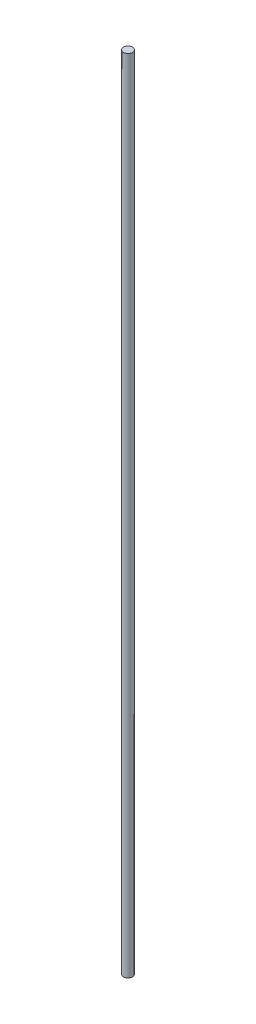
ISO-10303-21;
HEADER;
FILE_DESCRIPTION(('STEP AP214'),'2;1');
FILE_NAME('part.step','',(''),(''),'','','');
FILE_SCHEMA(('AUTOMOTIVE_DESIGN { 1 0 10303 214 1 1 1 1 }'));
ENDSEC;
DATA;
#1=APPLICATION_CONTEXT('core data for automotive mechanical design processes');
#2=APPLICATION_PROTOCOL_DEFINITION('international standard','automotive_design',2000,#1);
#3=PRODUCT_CONTEXT('',#1,'mechanical');
#4=PRODUCT('Part','Part','',(#3));
#5=PRODUCT_RELATED_PRODUCT_CATEGORY('part','',(#4));
#6=PRODUCT_DEFINITION_FORMATION('','',#4);
#7=PRODUCT_DEFINITION_CONTEXT('part definition',#1,'design');
#8=PRODUCT_DEFINITION('design','',#6,#7);
#9=PRODUCT_DEFINITION_SHAPE('','',#8);
#10=(LENGTH_UNIT() NAMED_UNIT(*) SI_UNIT(.MILLI.,.METRE.));
#11=(NAMED_UNIT(*) PLANE_ANGLE_UNIT() SI_UNIT($,.RADIAN.));
#12=(NAMED_UNIT(*) SI_UNIT($,.STERADIAN.) SOLID_ANGLE_UNIT());
#13=UNCERTAINTY_MEASURE_WITH_UNIT(LENGTH_MEASURE(1.E-05),#10,'distance_accuracy_value','');
#14=(GEOMETRIC_REPRESENTATION_CONTEXT(3) GLOBAL_UNCERTAINTY_ASSIGNED_CONTEXT((#13)) GLOBAL_UNIT_ASSIGNED_CONTEXT((#10,
#11,#12)) REPRESENTATION_CONTEXT('',''));
#15=CARTESIAN_POINT('',(0.,0.,0.));
#16=DIRECTION('',(0.,0.,1.));
#17=DIRECTION('',(1.,0.,0.));
#18=AXIS2_PLACEMENT_3D('',#15,#16,#17);
#19=CARTESIAN_POINT('',(0.,700.,0.));
#20=DIRECTION('',(0.,-1.,0.));
#21=DIRECTION('',(1.,0.,0.));
#22=AXIS2_PLACEMENT_3D('',#19,#20,#21);
#23=CYLINDRICAL_SURFACE('',#22,4.00000000000005);
#24=CARTESIAN_POINT('',(0.,700.,0.));
#25=DIRECTION('',(0.,-1.,0.));
#26=DIRECTION('',(1.,0.,0.));
#27=AXIS2_PLACEMENT_3D('',#24,#25,#26);
#28=CIRCLE('',#27,4.00000000000009);
#29=CARTESIAN_POINT('',(4.00000000000017,700.,0.));
#30=VERTEX_POINT('',#29);
#31=EDGE_CURVE('E10',#30,#30,#28,.T.);
#32=ORIENTED_EDGE('',*,*,#31,.T.);
#33=EDGE_LOOP('',(#32));
#34=FACE_BOUND('',#33,.T.);
#35=CARTESIAN_POINT('',(1.66533453693773E-13,0.,0.));
#36=DIRECTION('',(0.,-1.,0.));
#37=DIRECTION('',(1.,0.,0.));
#38=AXIS2_PLACEMENT_3D('',#35,#36,#37);
#39=CIRCLE('',#38,4.);
#40=CARTESIAN_POINT('',(4.00000000000017,0.,0.));
#41=VERTEX_POINT('',#40);
#42=EDGE_CURVE('E44',#41,#41,#39,.T.);
#43=ORIENTED_EDGE('',*,*,#42,.F.);
#44=EDGE_LOOP('',(#43));
#45=FACE_BOUND('',#44,.T.);
#46=ADVANCED_FACE('F37',(#34,#45),#23,.T.);
#47=CARTESIAN_POINT('',(4.00000000000017,700.,0.));
#48=DIRECTION('',(0.,1.,0.));
#49=DIRECTION('',(-1.,0.,0.));
#50=AXIS2_PLACEMENT_3D('',#47,#48,#49);
#51=PLANE('',#50);
#52=ORIENTED_EDGE('',*,*,#31,.F.);
#53=EDGE_LOOP('',(#52));
#54=FACE_BOUND('',#53,.T.);
#55=ADVANCED_FACE('F54',(#54),#51,.T.);
#56=CARTESIAN_POINT('',(1.66533453693773E-13,0.,0.));
#57=DIRECTION('',(0.,-1.,0.));
#58=DIRECTION('',(1.,0.,0.));
#59=AXIS2_PLACEMENT_3D('',#56,#57,#58);
#60=PLANE('',#59);
#61=ORIENTED_EDGE('',*,*,#42,.T.);
#62=EDGE_LOOP('',(#61));
#63=FACE_BOUND('',#62,.T.);
#64=ADVANCED_FACE('F51',(#63),#60,.T.);
#65=CLOSED_SHELL('',(#46,#55,#64));
#66=MANIFOLD_SOLID_BREP('B2',#65);
#67=ADVANCED_BREP_SHAPE_REPRESENTATION('',(#18,#66),#14);
#68=SHAPE_DEFINITION_REPRESENTATION(#9,#67);
ENDSEC;
END-ISO-10303-21;
